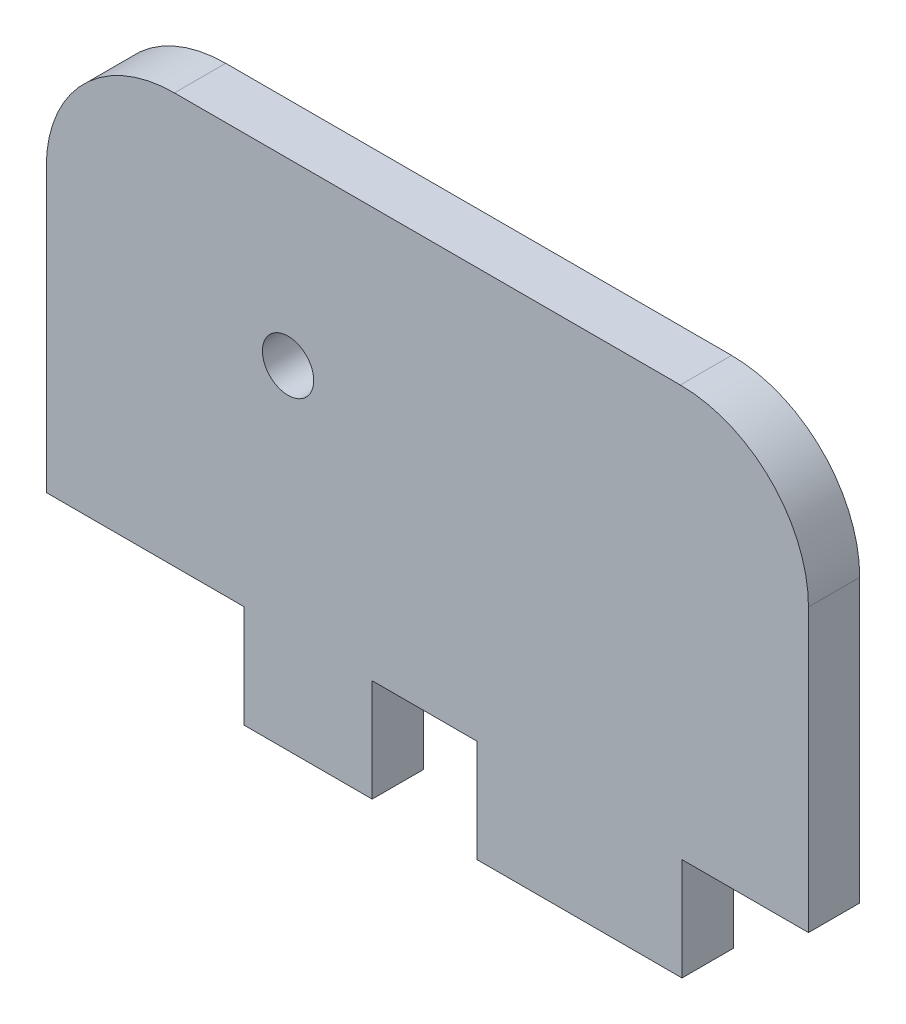
ISO-10303-21;
HEADER;
FILE_DESCRIPTION(('STEP AP214'),'2;1');
FILE_NAME('part.step','',(''),(''),'','','');
FILE_SCHEMA(('AUTOMOTIVE_DESIGN { 1 0 10303 214 1 1 1 1 }'));
ENDSEC;
DATA;
#1=APPLICATION_CONTEXT('core data for automotive mechanical design processes');
#2=APPLICATION_PROTOCOL_DEFINITION('international standard','automotive_design',2000,#1);
#3=PRODUCT_CONTEXT('',#1,'mechanical');
#4=PRODUCT('Part','Part','',(#3));
#5=PRODUCT_RELATED_PRODUCT_CATEGORY('part','',(#4));
#6=PRODUCT_DEFINITION_FORMATION('','',#4);
#7=PRODUCT_DEFINITION_CONTEXT('part definition',#1,'design');
#8=PRODUCT_DEFINITION('design','',#6,#7);
#9=PRODUCT_DEFINITION_SHAPE('','',#8);
#10=(LENGTH_UNIT() NAMED_UNIT(*) SI_UNIT(.MILLI.,.METRE.));
#11=(NAMED_UNIT(*) PLANE_ANGLE_UNIT() SI_UNIT($,.RADIAN.));
#12=(NAMED_UNIT(*) SI_UNIT($,.STERADIAN.) SOLID_ANGLE_UNIT());
#13=UNCERTAINTY_MEASURE_WITH_UNIT(LENGTH_MEASURE(1.E-05),#10,'distance_accuracy_value','');
#14=(GEOMETRIC_REPRESENTATION_CONTEXT(3) GLOBAL_UNCERTAINTY_ASSIGNED_CONTEXT((#13)) GLOBAL_UNIT_ASSIGNED_CONTEXT((#10,
#11,#12)) REPRESENTATION_CONTEXT('',''));
#15=CARTESIAN_POINT('',(0.,0.,0.));
#16=DIRECTION('',(0.,0.,1.));
#17=DIRECTION('',(1.,0.,0.));
#18=AXIS2_PLACEMENT_3D('',#15,#16,#17);
#19=CARTESIAN_POINT('',(-9.86584110472118,10.,2.));
#20=DIRECTION('',(0.,0.,-1.));
#21=DIRECTION('',(-1.,0.,0.));
#22=AXIS2_PLACEMENT_3D('',#19,#20,#21);
#23=PLANE('',#22);
#24=DIRECTION('',(0.,1.,0.));
#25=VECTOR('',#24,1.);
#26=CARTESIAN_POINT('',(-2.15187398526033,-1.,2.));
#27=LINE('',#26,#25);
#28=CARTESIAN_POINT('',(-2.15187398526033,-5.,2.));
#29=VERTEX_POINT('',#28);
#30=CARTESIAN_POINT('',(-2.15187398526033,-1.,2.));
#31=VERTEX_POINT('',#30);
#32=EDGE_CURVE('E192',#29,#31,#27,.T.);
#33=ORIENTED_EDGE('',*,*,#32,.T.);
#34=DIRECTION('',(1.,0.,0.));
#35=VECTOR('',#34,1.);
#36=CARTESIAN_POINT('',(1.93266689999142,-1.,2.));
#37=LINE('',#36,#35);
#38=CARTESIAN_POINT('',(1.93266689999142,-1.,2.));
#39=VERTEX_POINT('',#38);
#40=EDGE_CURVE('E110',#31,#39,#37,.T.);
#41=ORIENTED_EDGE('',*,*,#40,.T.);
#42=DIRECTION('',(0.,-1.,0.));
#43=VECTOR('',#42,1.);
#44=CARTESIAN_POINT('',(1.93266689999142,-5.,2.));
#45=LINE('',#44,#43);
#46=CARTESIAN_POINT('',(1.93266689999142,-5.,2.));
#47=VERTEX_POINT('',#46);
#48=EDGE_CURVE('E225',#39,#47,#45,.T.);
#49=ORIENTED_EDGE('',*,*,#48,.T.);
#50=DIRECTION('',(1.,0.,0.));
#51=VECTOR('',#50,1.);
#52=CARTESIAN_POINT('',(9.93266689999142,-5.,2.));
#53=LINE('',#52,#51);
#54=CARTESIAN_POINT('',(9.93266689999142,-5.,2.));
#55=VERTEX_POINT('',#54);
#56=EDGE_CURVE('E244',#47,#55,#53,.T.);
#57=ORIENTED_EDGE('',*,*,#56,.T.);
#58=DIRECTION('',(0.,1.,0.));
#59=VECTOR('',#58,1.);
#60=CARTESIAN_POINT('',(9.93266689999142,-1.,2.));
#61=LINE('',#60,#59);
#62=CARTESIAN_POINT('',(9.93266689999142,-1.,2.));
#63=VERTEX_POINT('',#62);
#64=EDGE_CURVE('E241',#55,#63,#61,.T.);
#65=ORIENTED_EDGE('',*,*,#64,.T.);
#66=DIRECTION('',(1.,0.,0.));
#67=VECTOR('',#66,1.);
#68=CARTESIAN_POINT('',(9.93266689999142,-1.,2.));
#69=LINE('',#68,#67);
#70=CARTESIAN_POINT('',(14.8658411047212,-1.,2.));
#71=VERTEX_POINT('',#70);
#72=EDGE_CURVE('E243',#63,#71,#69,.T.);
#73=ORIENTED_EDGE('',*,*,#72,.T.);
#74=DIRECTION('',(0.,1.,0.));
#75=VECTOR('',#74,1.);
#76=CARTESIAN_POINT('',(14.8658411047212,9.99999999999996,2.));
#77=LINE('',#76,#75);
#78=CARTESIAN_POINT('',(14.8658411047212,9.99999999999996,2.));
#79=VERTEX_POINT('',#78);
#80=EDGE_CURVE('E246',#71,#79,#77,.T.);
#81=ORIENTED_EDGE('',*,*,#80,.T.);
#82=CARTESIAN_POINT('',(9.86584110472118,10.,2.));
#83=DIRECTION('',(0.,0.,1.));
#84=DIRECTION('',(1.,0.,0.));
#85=AXIS2_PLACEMENT_3D('',#82,#83,#84);
#86=CIRCLE('',#85,5.);
#87=CARTESIAN_POINT('',(9.86584110472115,15.,2.));
#88=VERTEX_POINT('',#87);
#89=EDGE_CURVE('E252',#79,#88,#86,.T.);
#90=ORIENTED_EDGE('',*,*,#89,.T.);
#91=DIRECTION('',(-1.,0.,0.));
#92=VECTOR('',#91,1.);
#93=CARTESIAN_POINT('',(9.86584110472115,15.,2.));
#94=LINE('',#93,#92);
#95=CARTESIAN_POINT('',(-9.86584110472115,15.,2.));
#96=VERTEX_POINT('',#95);
#97=EDGE_CURVE('E254',#88,#96,#94,.T.);
#98=ORIENTED_EDGE('',*,*,#97,.T.);
#99=CARTESIAN_POINT('',(-9.86584110472118,10.,2.));
#100=DIRECTION('',(0.,0.,1.));
#101=DIRECTION('',(-1.,0.,0.));
#102=AXIS2_PLACEMENT_3D('',#99,#100,#101);
#103=CIRCLE('',#102,5.);
#104=CARTESIAN_POINT('',(-14.8658411047212,9.99999999999996,2.));
#105=VERTEX_POINT('',#104);
#106=EDGE_CURVE('E256',#96,#105,#103,.T.);
#107=ORIENTED_EDGE('',*,*,#106,.T.);
#108=DIRECTION('',(0.,-1.,0.));
#109=VECTOR('',#108,1.);
#110=CARTESIAN_POINT('',(-14.8658411047212,9.99999999999996,2.));
#111=LINE('',#110,#109);
#112=CARTESIAN_POINT('',(-14.8658411047212,-1.00000000000001,2.));
#113=VERTEX_POINT('',#112);
#114=EDGE_CURVE('E147',#105,#113,#111,.T.);
#115=ORIENTED_EDGE('',*,*,#114,.T.);
#116=DIRECTION('',(1.,0.,0.));
#117=VECTOR('',#116,1.);
#118=CARTESIAN_POINT('',(-7.15187398526034,-1.,2.));
#119=LINE('',#118,#117);
#120=CARTESIAN_POINT('',(-7.15187398526034,-1.,2.));
#121=VERTEX_POINT('',#120);
#122=EDGE_CURVE('E141',#113,#121,#119,.T.);
#123=ORIENTED_EDGE('',*,*,#122,.T.);
#124=DIRECTION('',(0.,-1.,0.));
#125=VECTOR('',#124,1.);
#126=CARTESIAN_POINT('',(-7.15187398526034,-1.,2.));
#127=LINE('',#126,#125);
#128=CARTESIAN_POINT('',(-7.15187398526034,-5.00000000000001,2.));
#129=VERTEX_POINT('',#128);
#130=EDGE_CURVE('E145',#121,#129,#127,.T.);
#131=ORIENTED_EDGE('',*,*,#130,.T.);
#132=DIRECTION('',(1.,0.,0.));
#133=VECTOR('',#132,1.);
#134=CARTESIAN_POINT('',(-7.15187398526034,-5.00000000000001,2.));
#135=LINE('',#134,#133);
#136=EDGE_CURVE('E49',#129,#29,#135,.T.);
#137=ORIENTED_EDGE('',*,*,#136,.T.);
#138=EDGE_LOOP('',(#33,#41,#49,#57,#65,#73,#81,#90,#98,#107,#115,#123,#131,#137));
#139=FACE_BOUND('',#138,.T.);
#140=CARTESIAN_POINT('',(-5.43415889527882,8.,2.));
#141=DIRECTION('',(0.,0.,1.));
#142=DIRECTION('',(1.,0.,0.));
#143=AXIS2_PLACEMENT_3D('',#140,#141,#142);
#144=CIRCLE('',#143,1.);
#145=CARTESIAN_POINT('',(-4.43415889527882,8.,2.));
#146=VERTEX_POINT('',#145);
#147=EDGE_CURVE('E169',#146,#146,#144,.T.);
#148=ORIENTED_EDGE('',*,*,#147,.F.);
#149=EDGE_LOOP('',(#148));
#150=FACE_BOUND('',#149,.T.);
#151=ADVANCED_FACE('F32',(#139,#150),#23,.F.);
#152=CARTESIAN_POINT('',(-9.86584110472118,10.,0.));
#153=DIRECTION('',(0.,0.,-1.));
#154=DIRECTION('',(-1.,0.,0.));
#155=AXIS2_PLACEMENT_3D('',#152,#153,#154);
#156=PLANE('',#155);
#157=DIRECTION('',(0.,1.,0.));
#158=VECTOR('',#157,1.);
#159=CARTESIAN_POINT('',(-2.15187398526033,-1.,0.));
#160=LINE('',#159,#158);
#161=CARTESIAN_POINT('',(-2.15187398526033,-5.,0.));
#162=VERTEX_POINT('',#161);
#163=CARTESIAN_POINT('',(-2.15187398526033,-1.,0.));
#164=VERTEX_POINT('',#163);
#165=EDGE_CURVE('E165',#162,#164,#160,.T.);
#166=ORIENTED_EDGE('',*,*,#165,.F.);
#167=DIRECTION('',(1.,0.,0.));
#168=VECTOR('',#167,1.);
#169=CARTESIAN_POINT('',(-7.15187398526034,-5.00000000000001,0.));
#170=LINE('',#169,#168);
#171=CARTESIAN_POINT('',(-7.15187398526034,-5.00000000000001,0.));
#172=VERTEX_POINT('',#171);
#173=EDGE_CURVE('E102',#172,#162,#170,.T.);
#174=ORIENTED_EDGE('',*,*,#173,.F.);
#175=DIRECTION('',(0.,-1.,0.));
#176=VECTOR('',#175,1.);
#177=CARTESIAN_POINT('',(-7.15187398526034,-1.,0.));
#178=LINE('',#177,#176);
#179=CARTESIAN_POINT('',(-7.15187398526034,-1.,0.));
#180=VERTEX_POINT('',#179);
#181=EDGE_CURVE('E96',#180,#172,#178,.T.);
#182=ORIENTED_EDGE('',*,*,#181,.F.);
#183=DIRECTION('',(1.,0.,0.));
#184=VECTOR('',#183,1.);
#185=CARTESIAN_POINT('',(-7.15187398526034,-1.,0.));
#186=LINE('',#185,#184);
#187=CARTESIAN_POINT('',(-14.8658411047212,-1.00000000000001,0.));
#188=VERTEX_POINT('',#187);
#189=EDGE_CURVE('E155',#188,#180,#186,.T.);
#190=ORIENTED_EDGE('',*,*,#189,.F.);
#191=DIRECTION('',(0.,-1.,0.));
#192=VECTOR('',#191,1.);
#193=CARTESIAN_POINT('',(-14.8658411047212,9.99999999999996,0.));
#194=LINE('',#193,#192);
#195=CARTESIAN_POINT('',(-14.8658411047212,9.99999999999996,0.));
#196=VERTEX_POINT('',#195);
#197=EDGE_CURVE('E187',#196,#188,#194,.T.);
#198=ORIENTED_EDGE('',*,*,#197,.F.);
#199=CARTESIAN_POINT('',(-9.86584110472118,10.,0.));
#200=DIRECTION('',(0.,0.,1.));
#201=DIRECTION('',(-1.,0.,0.));
#202=AXIS2_PLACEMENT_3D('',#199,#200,#201);
#203=CIRCLE('',#202,5.);
#204=CARTESIAN_POINT('',(-9.86584110472115,15.,0.));
#205=VERTEX_POINT('',#204);
#206=EDGE_CURVE('E185',#205,#196,#203,.T.);
#207=ORIENTED_EDGE('',*,*,#206,.F.);
#208=DIRECTION('',(-1.,0.,0.));
#209=VECTOR('',#208,1.);
#210=CARTESIAN_POINT('',(9.86584110472115,15.,0.));
#211=LINE('',#210,#209);
#212=CARTESIAN_POINT('',(9.86584110472115,15.,0.));
#213=VERTEX_POINT('',#212);
#214=EDGE_CURVE('E183',#213,#205,#211,.T.);
#215=ORIENTED_EDGE('',*,*,#214,.F.);
#216=CARTESIAN_POINT('',(9.86584110472118,10.,0.));
#217=DIRECTION('',(0.,0.,1.));
#218=DIRECTION('',(1.,0.,0.));
#219=AXIS2_PLACEMENT_3D('',#216,#217,#218);
#220=CIRCLE('',#219,5.);
#221=CARTESIAN_POINT('',(14.8658411047212,9.99999999999996,0.));
#222=VERTEX_POINT('',#221);
#223=EDGE_CURVE('E181',#222,#213,#220,.T.);
#224=ORIENTED_EDGE('',*,*,#223,.F.);
#225=DIRECTION('',(0.,1.,0.));
#226=VECTOR('',#225,1.);
#227=CARTESIAN_POINT('',(14.8658411047212,9.99999999999996,0.));
#228=LINE('',#227,#226);
#229=CARTESIAN_POINT('',(14.8658411047212,-1.,0.));
#230=VERTEX_POINT('',#229);
#231=EDGE_CURVE('E179',#230,#222,#228,.T.);
#232=ORIENTED_EDGE('',*,*,#231,.F.);
#233=DIRECTION('',(1.,0.,0.));
#234=VECTOR('',#233,1.);
#235=CARTESIAN_POINT('',(9.93266689999142,-1.,0.));
#236=LINE('',#235,#234);
#237=CARTESIAN_POINT('',(9.93266689999142,-1.,0.));
#238=VERTEX_POINT('',#237);
#239=EDGE_CURVE('E177',#238,#230,#236,.T.);
#240=ORIENTED_EDGE('',*,*,#239,.F.);
#241=DIRECTION('',(0.,1.,0.));
#242=VECTOR('',#241,1.);
#243=CARTESIAN_POINT('',(9.93266689999142,-1.,0.));
#244=LINE('',#243,#242);
#245=CARTESIAN_POINT('',(9.93266689999142,-5.,0.));
#246=VERTEX_POINT('',#245);
#247=EDGE_CURVE('E175',#246,#238,#244,.T.);
#248=ORIENTED_EDGE('',*,*,#247,.F.);
#249=DIRECTION('',(1.,0.,0.));
#250=VECTOR('',#249,1.);
#251=CARTESIAN_POINT('',(9.93266689999142,-5.,0.));
#252=LINE('',#251,#250);
#253=CARTESIAN_POINT('',(1.93266689999142,-5.,0.));
#254=VERTEX_POINT('',#253);
#255=EDGE_CURVE('E173',#254,#246,#252,.T.);
#256=ORIENTED_EDGE('',*,*,#255,.F.);
#257=DIRECTION('',(0.,-1.,0.));
#258=VECTOR('',#257,1.);
#259=CARTESIAN_POINT('',(1.93266689999142,-5.,0.));
#260=LINE('',#259,#258);
#261=CARTESIAN_POINT('',(1.93266689999142,-1.,0.));
#262=VERTEX_POINT('',#261);
#263=EDGE_CURVE('E171',#262,#254,#260,.T.);
#264=ORIENTED_EDGE('',*,*,#263,.F.);
#265=DIRECTION('',(1.,0.,0.));
#266=VECTOR('',#265,1.);
#267=CARTESIAN_POINT('',(1.93266689999142,-1.,0.));
#268=LINE('',#267,#266);
#269=EDGE_CURVE('E168',#164,#262,#268,.T.);
#270=ORIENTED_EDGE('',*,*,#269,.F.);
#271=EDGE_LOOP('',(#166,#174,#182,#190,#198,#207,#215,#224,#232,#240,#248,#256,#264,#270));
#272=FACE_BOUND('',#271,.T.);
#273=CARTESIAN_POINT('',(-5.43415889527882,8.,0.));
#274=DIRECTION('',(0.,0.,1.));
#275=DIRECTION('',(1.,0.,0.));
#276=AXIS2_PLACEMENT_3D('',#273,#274,#275);
#277=CIRCLE('',#276,1.);
#278=CARTESIAN_POINT('',(-4.43415889527882,8.,0.));
#279=VERTEX_POINT('',#278);
#280=EDGE_CURVE('E429',#279,#279,#277,.T.);
#281=ORIENTED_EDGE('',*,*,#280,.T.);
#282=EDGE_LOOP('',(#281));
#283=FACE_BOUND('',#282,.T.);
#284=ADVANCED_FACE('F229',(#272,#283),#156,.T.);
#285=CARTESIAN_POINT('',(-2.15187398526033,-1.,2.));
#286=DIRECTION('',(-1.,0.,0.));
#287=DIRECTION('',(0.,0.,1.));
#288=AXIS2_PLACEMENT_3D('',#285,#286,#287);
#289=PLANE('',#288);
#290=ORIENTED_EDGE('',*,*,#165,.T.);
#291=DIRECTION('',(0.,0.,-1.));
#292=VECTOR('',#291,1.);
#293=CARTESIAN_POINT('',(-2.15187398526033,-1.,2.));
#294=LINE('',#293,#292);
#295=EDGE_CURVE('E11',#31,#164,#294,.T.);
#296=ORIENTED_EDGE('',*,*,#295,.F.);
#297=ORIENTED_EDGE('',*,*,#32,.F.);
#298=DIRECTION('',(0.,0.,-1.));
#299=VECTOR('',#298,1.);
#300=CARTESIAN_POINT('',(-2.15187398526033,-5.,2.));
#301=LINE('',#300,#299);
#302=EDGE_CURVE('E161',#29,#162,#301,.T.);
#303=ORIENTED_EDGE('',*,*,#302,.T.);
#304=EDGE_LOOP('',(#290,#296,#297,#303));
#305=FACE_BOUND('',#304,.T.);
#306=ADVANCED_FACE('F34',(#305),#289,.F.);
#307=CARTESIAN_POINT('',(1.93266689999142,-1.,2.));
#308=DIRECTION('',(0.,1.,0.));
#309=DIRECTION('',(-1.,0.,0.));
#310=AXIS2_PLACEMENT_3D('',#307,#308,#309);
#311=PLANE('',#310);
#312=ORIENTED_EDGE('',*,*,#269,.T.);
#313=DIRECTION('',(0.,0.,-1.));
#314=VECTOR('',#313,1.);
#315=CARTESIAN_POINT('',(1.93266689999142,-1.,2.));
#316=LINE('',#315,#314);
#317=EDGE_CURVE('E41',#39,#262,#316,.T.);
#318=ORIENTED_EDGE('',*,*,#317,.F.);
#319=ORIENTED_EDGE('',*,*,#40,.F.);
#320=ORIENTED_EDGE('',*,*,#295,.T.);
#321=EDGE_LOOP('',(#312,#318,#319,#320));
#322=FACE_BOUND('',#321,.T.);
#323=ADVANCED_FACE('F290',(#322),#311,.F.);
#324=CARTESIAN_POINT('',(1.93266689999142,-5.,2.));
#325=DIRECTION('',(1.,0.,0.));
#326=DIRECTION('',(0.,0.,-1.));
#327=AXIS2_PLACEMENT_3D('',#324,#325,#326);
#328=PLANE('',#327);
#329=ORIENTED_EDGE('',*,*,#263,.T.);
#330=DIRECTION('',(0.,0.,-1.));
#331=VECTOR('',#330,1.);
#332=CARTESIAN_POINT('',(1.93266689999142,-5.,2.));
#333=LINE('',#332,#331);
#334=EDGE_CURVE('E217',#47,#254,#333,.T.);
#335=ORIENTED_EDGE('',*,*,#334,.F.);
#336=ORIENTED_EDGE('',*,*,#48,.F.);
#337=ORIENTED_EDGE('',*,*,#317,.T.);
#338=EDGE_LOOP('',(#329,#335,#336,#337));
#339=FACE_BOUND('',#338,.T.);
#340=ADVANCED_FACE('F223',(#339),#328,.F.);
#341=CARTESIAN_POINT('',(9.93266689999142,-5.,2.));
#342=DIRECTION('',(0.,1.,0.));
#343=DIRECTION('',(-1.,0.,0.));
#344=AXIS2_PLACEMENT_3D('',#341,#342,#343);
#345=PLANE('',#344);
#346=ORIENTED_EDGE('',*,*,#255,.T.);
#347=DIRECTION('',(0.,0.,-1.));
#348=VECTOR('',#347,1.);
#349=CARTESIAN_POINT('',(9.93266689999142,-5.,2.));
#350=LINE('',#349,#348);
#351=EDGE_CURVE('E214',#55,#246,#350,.T.);
#352=ORIENTED_EDGE('',*,*,#351,.F.);
#353=ORIENTED_EDGE('',*,*,#56,.F.);
#354=ORIENTED_EDGE('',*,*,#334,.T.);
#355=EDGE_LOOP('',(#346,#352,#353,#354));
#356=FACE_BOUND('',#355,.T.);
#357=ADVANCED_FACE('F235',(#356),#345,.F.);
#358=CARTESIAN_POINT('',(9.93266689999142,-1.,2.));
#359=DIRECTION('',(-1.,0.,0.));
#360=DIRECTION('',(0.,0.,1.));
#361=AXIS2_PLACEMENT_3D('',#358,#359,#360);
#362=PLANE('',#361);
#363=ORIENTED_EDGE('',*,*,#247,.T.);
#364=DIRECTION('',(0.,0.,-1.));
#365=VECTOR('',#364,1.);
#366=CARTESIAN_POINT('',(9.93266689999142,-1.,2.));
#367=LINE('',#366,#365);
#368=EDGE_CURVE('E211',#63,#238,#367,.T.);
#369=ORIENTED_EDGE('',*,*,#368,.F.);
#370=ORIENTED_EDGE('',*,*,#64,.F.);
#371=ORIENTED_EDGE('',*,*,#351,.T.);
#372=EDGE_LOOP('',(#363,#369,#370,#371));
#373=FACE_BOUND('',#372,.T.);
#374=ADVANCED_FACE('F239',(#373),#362,.F.);
#375=CARTESIAN_POINT('',(9.93266689999142,-1.,2.));
#376=DIRECTION('',(0.,1.,0.));
#377=DIRECTION('',(0.,0.,1.));
#378=AXIS2_PLACEMENT_3D('',#375,#376,#377);
#379=PLANE('',#378);
#380=ORIENTED_EDGE('',*,*,#239,.T.);
#381=DIRECTION('',(0.,0.,-1.));
#382=VECTOR('',#381,1.);
#383=CARTESIAN_POINT('',(14.8658411047212,-1.,2.));
#384=LINE('',#383,#382);
#385=EDGE_CURVE('E208',#71,#230,#384,.T.);
#386=ORIENTED_EDGE('',*,*,#385,.F.);
#387=ORIENTED_EDGE('',*,*,#72,.F.);
#388=ORIENTED_EDGE('',*,*,#368,.T.);
#389=EDGE_LOOP('',(#380,#386,#387,#388));
#390=FACE_BOUND('',#389,.T.);
#391=ADVANCED_FACE('F303',(#390),#379,.F.);
#392=CARTESIAN_POINT('',(14.8658411047212,9.99999999999996,2.));
#393=DIRECTION('',(-1.,0.,0.));
#394=DIRECTION('',(0.,-1.,0.));
#395=AXIS2_PLACEMENT_3D('',#392,#393,#394);
#396=PLANE('',#395);
#397=ORIENTED_EDGE('',*,*,#231,.T.);
#398=DIRECTION('',(0.,0.,-1.));
#399=VECTOR('',#398,1.);
#400=CARTESIAN_POINT('',(14.8658411047212,9.99999999999996,2.));
#401=LINE('',#400,#399);
#402=EDGE_CURVE('E205',#79,#222,#401,.T.);
#403=ORIENTED_EDGE('',*,*,#402,.F.);
#404=ORIENTED_EDGE('',*,*,#80,.F.);
#405=ORIENTED_EDGE('',*,*,#385,.T.);
#406=EDGE_LOOP('',(#397,#403,#404,#405));
#407=FACE_BOUND('',#406,.T.);
#408=ADVANCED_FACE('F306',(#407),#396,.F.);
#409=CARTESIAN_POINT('',(9.86584110472118,10.,2.));
#410=DIRECTION('',(0.,0.,-1.));
#411=DIRECTION('',(-1.,0.,0.));
#412=AXIS2_PLACEMENT_3D('',#409,#410,#411);
#413=CYLINDRICAL_SURFACE('',#412,5.);
#414=ORIENTED_EDGE('',*,*,#223,.T.);
#415=DIRECTION('',(0.,0.,-1.));
#416=VECTOR('',#415,1.);
#417=CARTESIAN_POINT('',(9.86584110472115,15.,2.));
#418=LINE('',#417,#416);
#419=EDGE_CURVE('E202',#88,#213,#418,.T.);
#420=ORIENTED_EDGE('',*,*,#419,.F.);
#421=ORIENTED_EDGE('',*,*,#89,.F.);
#422=ORIENTED_EDGE('',*,*,#402,.T.);
#423=EDGE_LOOP('',(#414,#420,#421,#422));
#424=FACE_BOUND('',#423,.T.);
#425=ADVANCED_FACE('F310',(#424),#413,.T.);
#426=CARTESIAN_POINT('',(9.86584110472115,15.,2.));
#427=DIRECTION('',(0.,-1.,0.));
#428=DIRECTION('',(1.,0.,0.));
#429=AXIS2_PLACEMENT_3D('',#426,#427,#428);
#430=PLANE('',#429);
#431=ORIENTED_EDGE('',*,*,#214,.T.);
#432=DIRECTION('',(0.,0.,-1.));
#433=VECTOR('',#432,1.);
#434=CARTESIAN_POINT('',(-9.86584110472115,15.,2.));
#435=LINE('',#434,#433);
#436=EDGE_CURVE('E199',#96,#205,#435,.T.);
#437=ORIENTED_EDGE('',*,*,#436,.F.);
#438=ORIENTED_EDGE('',*,*,#97,.F.);
#439=ORIENTED_EDGE('',*,*,#419,.T.);
#440=EDGE_LOOP('',(#431,#437,#438,#439));
#441=FACE_BOUND('',#440,.T.);
#442=ADVANCED_FACE('F314',(#441),#430,.F.);
#443=CARTESIAN_POINT('',(-9.86584110472118,10.,2.));
#444=DIRECTION('',(0.,0.,-1.));
#445=DIRECTION('',(-1.,0.,0.));
#446=AXIS2_PLACEMENT_3D('',#443,#444,#445);
#447=CYLINDRICAL_SURFACE('',#446,5.);
#448=ORIENTED_EDGE('',*,*,#206,.T.);
#449=DIRECTION('',(0.,0.,-1.));
#450=VECTOR('',#449,1.);
#451=CARTESIAN_POINT('',(-14.8658411047212,9.99999999999996,2.));
#452=LINE('',#451,#450);
#453=EDGE_CURVE('E196',#105,#196,#452,.T.);
#454=ORIENTED_EDGE('',*,*,#453,.F.);
#455=ORIENTED_EDGE('',*,*,#106,.F.);
#456=ORIENTED_EDGE('',*,*,#436,.T.);
#457=EDGE_LOOP('',(#448,#454,#455,#456));
#458=FACE_BOUND('',#457,.T.);
#459=ADVANCED_FACE('F262',(#458),#447,.T.);
#460=CARTESIAN_POINT('',(-14.8658411047212,9.99999999999996,2.));
#461=DIRECTION('',(1.,0.,0.));
#462=DIRECTION('',(0.,0.,-1.));
#463=AXIS2_PLACEMENT_3D('',#460,#461,#462);
#464=PLANE('',#463);
#465=ORIENTED_EDGE('',*,*,#197,.T.);
#466=DIRECTION('',(0.,0.,-1.));
#467=VECTOR('',#466,1.);
#468=CARTESIAN_POINT('',(-14.8658411047212,-1.00000000000001,2.));
#469=LINE('',#468,#467);
#470=EDGE_CURVE('E156',#113,#188,#469,.T.);
#471=ORIENTED_EDGE('',*,*,#470,.F.);
#472=ORIENTED_EDGE('',*,*,#114,.F.);
#473=ORIENTED_EDGE('',*,*,#453,.T.);
#474=EDGE_LOOP('',(#465,#471,#472,#473));
#475=FACE_BOUND('',#474,.T.);
#476=ADVANCED_FACE('F266',(#475),#464,.F.);
#477=CARTESIAN_POINT('',(-7.15187398526034,-1.,2.));
#478=DIRECTION('',(0.,1.,0.));
#479=DIRECTION('',(-1.,0.,0.));
#480=AXIS2_PLACEMENT_3D('',#477,#478,#479);
#481=PLANE('',#480);
#482=ORIENTED_EDGE('',*,*,#189,.T.);
#483=DIRECTION('',(0.,0.,-1.));
#484=VECTOR('',#483,1.);
#485=CARTESIAN_POINT('',(-7.15187398526034,-1.,2.));
#486=LINE('',#485,#484);
#487=EDGE_CURVE('E152',#121,#180,#486,.T.);
#488=ORIENTED_EDGE('',*,*,#487,.F.);
#489=ORIENTED_EDGE('',*,*,#122,.F.);
#490=ORIENTED_EDGE('',*,*,#470,.T.);
#491=EDGE_LOOP('',(#482,#488,#489,#490));
#492=FACE_BOUND('',#491,.T.);
#493=ADVANCED_FACE('F153',(#492),#481,.F.);
#494=CARTESIAN_POINT('',(-7.15187398526034,-1.,2.));
#495=DIRECTION('',(1.,0.,0.));
#496=DIRECTION('',(0.,1.,0.));
#497=AXIS2_PLACEMENT_3D('',#494,#495,#496);
#498=PLANE('',#497);
#499=ORIENTED_EDGE('',*,*,#181,.T.);
#500=DIRECTION('',(0.,0.,-1.));
#501=VECTOR('',#500,1.);
#502=CARTESIAN_POINT('',(-7.15187398526034,-5.00000000000001,2.));
#503=LINE('',#502,#501);
#504=EDGE_CURVE('E157',#129,#172,#503,.T.);
#505=ORIENTED_EDGE('',*,*,#504,.F.);
#506=ORIENTED_EDGE('',*,*,#130,.F.);
#507=ORIENTED_EDGE('',*,*,#487,.T.);
#508=EDGE_LOOP('',(#499,#505,#506,#507));
#509=FACE_BOUND('',#508,.T.);
#510=ADVANCED_FACE('F159',(#509),#498,.F.);
#511=CARTESIAN_POINT('',(-7.15187398526034,-5.00000000000001,2.));
#512=DIRECTION('',(0.,1.,0.));
#513=DIRECTION('',(-1.,0.,0.));
#514=AXIS2_PLACEMENT_3D('',#511,#512,#513);
#515=PLANE('',#514);
#516=ORIENTED_EDGE('',*,*,#173,.T.);
#517=ORIENTED_EDGE('',*,*,#302,.F.);
#518=ORIENTED_EDGE('',*,*,#136,.F.);
#519=ORIENTED_EDGE('',*,*,#504,.T.);
#520=EDGE_LOOP('',(#516,#517,#518,#519));
#521=FACE_BOUND('',#520,.T.);
#522=ADVANCED_FACE('F270',(#521),#515,.F.);
#523=CARTESIAN_POINT('',(-5.43415889527882,8.,2.));
#524=DIRECTION('',(0.,0.,-1.));
#525=DIRECTION('',(-1.,0.,0.));
#526=AXIS2_PLACEMENT_3D('',#523,#524,#525);
#527=CYLINDRICAL_SURFACE('',#526,1.);
#528=ORIENTED_EDGE('',*,*,#147,.T.);
#529=EDGE_LOOP('',(#528));
#530=FACE_BOUND('',#529,.T.);
#531=ORIENTED_EDGE('',*,*,#280,.F.);
#532=EDGE_LOOP('',(#531));
#533=FACE_BOUND('',#532,.T.);
#534=ADVANCED_FACE('F272',(#530,#533),#527,.F.);
#535=CLOSED_SHELL('',(#151,#284,#306,#323,#340,#357,#374,#391,#408,#425,#442,#459,#476,#493,
#510,#522,#534));
#536=MANIFOLD_SOLID_BREP('B2',#535);
#537=ADVANCED_BREP_SHAPE_REPRESENTATION('',(#18,#536),#14);
#538=SHAPE_DEFINITION_REPRESENTATION(#9,#537);
ENDSEC;
END-ISO-10303-21;
